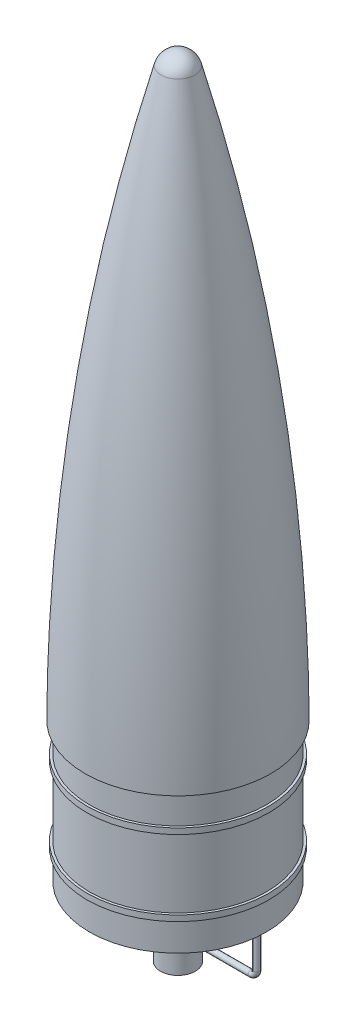
ISO-10303-21;
HEADER;
FILE_DESCRIPTION(('STEP AP214'),'2;1');
FILE_NAME('part.step','',(''),(''),'','','');
FILE_SCHEMA(('AUTOMOTIVE_DESIGN { 1 0 10303 214 1 1 1 1 }'));
ENDSEC;
DATA;
#1=APPLICATION_CONTEXT('core data for automotive mechanical design processes');
#2=APPLICATION_PROTOCOL_DEFINITION('international standard','automotive_design',2000,#1);
#3=PRODUCT_CONTEXT('',#1,'mechanical');
#4=PRODUCT('Part','Part','',(#3));
#5=PRODUCT_RELATED_PRODUCT_CATEGORY('part','',(#4));
#6=PRODUCT_DEFINITION_FORMATION('','',#4);
#7=PRODUCT_DEFINITION_CONTEXT('part definition',#1,'design');
#8=PRODUCT_DEFINITION('design','',#6,#7);
#9=PRODUCT_DEFINITION_SHAPE('','',#8);
#10=(LENGTH_UNIT() NAMED_UNIT(*) SI_UNIT(.MILLI.,.METRE.));
#11=(NAMED_UNIT(*) PLANE_ANGLE_UNIT() SI_UNIT($,.RADIAN.));
#12=(NAMED_UNIT(*) SI_UNIT($,.STERADIAN.) SOLID_ANGLE_UNIT());
#13=UNCERTAINTY_MEASURE_WITH_UNIT(LENGTH_MEASURE(1.E-05),#10,'distance_accuracy_value','');
#14=(GEOMETRIC_REPRESENTATION_CONTEXT(3) GLOBAL_UNCERTAINTY_ASSIGNED_CONTEXT((#13)) GLOBAL_UNIT_ASSIGNED_CONTEXT((#10,
#11,#12)) REPRESENTATION_CONTEXT('',''));
#15=CARTESIAN_POINT('',(0.,0.,0.));
#16=DIRECTION('',(0.,0.,1.));
#17=DIRECTION('',(1.,0.,0.));
#18=AXIS2_PLACEMENT_3D('',#15,#16,#17);
#19=CARTESIAN_POINT('',(0.,431.8,0.));
#20=DIRECTION('',(0.,1.,0.));
#21=DIRECTION('',(0.,0.,1.));
#22=AXIS2_PLACEMENT_3D('',#19,#20,#21);
#23=CYLINDRICAL_SURFACE('',#22,48.48225);
#24=CARTESIAN_POINT('',(0.,57.15,0.));
#25=DIRECTION('',(0.,-1.,0.));
#26=DIRECTION('',(1.,0.,0.));
#27=AXIS2_PLACEMENT_3D('',#24,#25,#26);
#28=CIRCLE('',#27,48.48225);
#29=CARTESIAN_POINT('',(48.48225,57.15,0.));
#30=VERTEX_POINT('',#29);
#31=EDGE_CURVE('E50',#30,#30,#28,.T.);
#32=ORIENTED_EDGE('',*,*,#31,.F.);
#33=EDGE_LOOP('',(#32));
#34=FACE_BOUND('',#33,.T.);
#35=CARTESIAN_POINT('',(0.,95.25,0.));
#36=DIRECTION('',(0.,1.,0.));
#37=DIRECTION('',(-1.,0.,0.));
#38=AXIS2_PLACEMENT_3D('',#35,#36,#37);
#39=CIRCLE('',#38,48.48225);
#40=CARTESIAN_POINT('',(-48.48225,95.25,0.));
#41=VERTEX_POINT('',#40);
#42=EDGE_CURVE('E42',#41,#41,#39,.T.);
#43=ORIENTED_EDGE('',*,*,#42,.F.);
#44=EDGE_LOOP('',(#43));
#45=FACE_BOUND('',#44,.T.);
#46=ADVANCED_FACE('F35',(#34,#45),#23,.T.);
#47=CARTESIAN_POINT('',(0.,38.1,0.));
#48=DIRECTION('',(0.,1.,0.));
#49=DIRECTION('',(0.,0.,1.));
#50=AXIS2_PLACEMENT_3D('',#47,#48,#49);
#51=CIRCLE('',#50,48.48225);
#52=CARTESIAN_POINT('',(0.,38.1,48.48225));
#53=VERTEX_POINT('',#52);
#54=EDGE_CURVE('E124',#53,#53,#51,.T.);
#55=ORIENTED_EDGE('',*,*,#54,.T.);
#56=EDGE_LOOP('',(#55));
#57=FACE_BOUND('',#56,.T.);
#58=CARTESIAN_POINT('',(0.,53.975,0.));
#59=DIRECTION('',(0.,1.,0.));
#60=DIRECTION('',(-1.,0.,0.));
#61=AXIS2_PLACEMENT_3D('',#58,#59,#60);
#62=CIRCLE('',#61,48.48225);
#63=CARTESIAN_POINT('',(-48.48225,53.975,0.));
#64=VERTEX_POINT('',#63);
#65=EDGE_CURVE('E46',#64,#64,#62,.T.);
#66=ORIENTED_EDGE('',*,*,#65,.F.);
#67=EDGE_LOOP('',(#66));
#68=FACE_BOUND('',#67,.T.);
#69=ADVANCED_FACE('F103',(#57,#68),#23,.T.);
#70=CARTESIAN_POINT('',(0.,0.,0.));
#71=DIRECTION('',(0.,1.,0.));
#72=DIRECTION('',(0.,0.,1.));
#73=AXIS2_PLACEMENT_3D('',#70,#71,#72);
#74=PLANE('',#73);
#75=CARTESIAN_POINT('',(0.,0.,0.));
#76=DIRECTION('',(0.,1.,0.));
#77=DIRECTION('',(0.,0.,1.));
#78=AXIS2_PLACEMENT_3D('',#75,#76,#77);
#79=CIRCLE('',#78,9.525);
#80=CARTESIAN_POINT('',(0.,0.,9.525));
#81=VERTEX_POINT('',#80);
#82=EDGE_CURVE('E55',#81,#81,#79,.T.);
#83=ORIENTED_EDGE('',*,*,#82,.F.);
#84=EDGE_LOOP('',(#83));
#85=FACE_BOUND('',#84,.T.);
#86=ADVANCED_FACE('F37',(#85),#74,.F.);
#87=CARTESIAN_POINT('',(0.,431.8,0.));
#88=DIRECTION('',(0.,1.,0.));
#89=DIRECTION('',(0.,0.,1.));
#90=AXIS2_PLACEMENT_3D('',#87,#88,#89);
#91=CYLINDRICAL_SURFACE('',#90,9.525);
#92=CARTESIAN_POINT('',(0.,12.7,0.));
#93=DIRECTION('',(0.,1.,0.));
#94=DIRECTION('',(0.,0.,1.));
#95=AXIS2_PLACEMENT_3D('',#92,#93,#94);
#96=CIRCLE('',#95,9.525);
#97=CARTESIAN_POINT('',(0.,12.7,9.525));
#98=VERTEX_POINT('',#97);
#99=EDGE_CURVE('E127',#98,#98,#96,.T.);
#100=ORIENTED_EDGE('',*,*,#99,.F.);
#101=EDGE_LOOP('',(#100));
#102=FACE_BOUND('',#101,.T.);
#103=ORIENTED_EDGE('',*,*,#82,.T.);
#104=EDGE_LOOP('',(#103));
#105=FACE_BOUND('',#104,.T.);
#106=ADVANCED_FACE('F110',(#102,#105),#91,.T.);
#107=CARTESIAN_POINT('',(0.,12.7,0.));
#108=DIRECTION('',(0.,1.,0.));
#109=DIRECTION('',(0.,0.,1.));
#110=AXIS2_PLACEMENT_3D('',#107,#108,#109);
#111=CONICAL_SURFACE('',#110,9.525,0.993018703001747);
#112=CARTESIAN_POINT('',(9.71792012786062,12.8294769945981,-0.331873864329069));
#113=CARTESIAN_POINT('',(9.70234682423112,12.8181502462647,-0.278876205071059));
#114=CARTESIAN_POINT('',(9.690245885196,12.8093283237202,-0.224263794411824));
#115=CARTESIAN_POINT('',(9.67397488450153,12.7974600952664,-0.113238438812971));
#116=CARTESIAN_POINT('',(9.66980490869855,12.7944138518817,-0.0568254743882384));
#117=CARTESIAN_POINT('',(9.66976603046798,12.7943854661708,0.0560656734355546));
#118=CARTESIAN_POINT('',(9.67390550344354,12.7974094422451,0.11254386523464));
#119=CARTESIAN_POINT('',(9.69013261747038,12.8092457483026,0.223709812647785));
#120=CARTESIAN_POINT('',(9.70222328557655,12.8180602827755,0.27839687804482));
#121=CARTESIAN_POINT('',(9.7328002773234,12.8402997037239,0.382569050190762));
#122=CARTESIAN_POINT('',(9.75102642970972,12.8535369015014,0.432172817017599));
#123=CARTESIAN_POINT('',(9.79288203723764,12.8838507510529,0.5277532124771));
#124=CARTESIAN_POINT('',(9.81651294528397,12.9009284352046,0.573728861322175));
#125=CARTESIAN_POINT('',(9.88453029076941,12.9499246163197,0.689714485216178));
#126=CARTESIAN_POINT('',(9.93258150228084,12.9843909325633,0.756498243839695));
#127=CARTESIAN_POINT('',(10.0367911171979,13.058686877832,0.880053044916495));
#128=CARTESIAN_POINT('',(10.0929734847468,13.0985323360795,0.936793348230162));
#129=CARTESIAN_POINT('',(10.1995530609206,13.1736583539186,1.03111905244148));
#130=CARTESIAN_POINT('',(10.2489906117193,13.2083469859976,1.0702906364624));
#131=CARTESIAN_POINT('',(10.3506276755289,13.2793187542795,1.14326788941303));
#132=CARTESIAN_POINT('',(10.4028289066843,13.3156028799481,1.17707016682207));
#133=CARTESIAN_POINT('',(10.562666367046,13.4261766250602,1.27128485521241));
#134=CARTESIAN_POINT('',(10.6734562427718,13.5021310626566,1.32443807385309));
#135=CARTESIAN_POINT('',(10.8823612009107,13.6440886657369,1.40764144318804));
#136=CARTESIAN_POINT('',(10.9797938844154,13.7098187138888,1.4399910176596));
#137=CARTESIAN_POINT('',(11.1770674531652,13.8420000020148,1.49458360945559));
#138=CARTESIAN_POINT('',(11.2769099455762,13.9084517060689,1.5168196740367));
#139=CARTESIAN_POINT('',(11.4782978012922,14.0416564874555,1.55214300396213));
#140=CARTESIAN_POINT('',(11.5798465088844,14.1084099064861,1.5652094369055));
#141=CARTESIAN_POINT('',(11.7837732229194,14.2417037507747,1.58272468726674));
#142=CARTESIAN_POINT('',(11.8861510134818,14.3082442255594,1.58717567987911));
#143=CARTESIAN_POINT('',(12.0974104864671,14.4448469821379,1.58780879162158));
#144=CARTESIAN_POINT('',(12.2063125753617,14.514880049168,1.58347683282436));
#145=CARTESIAN_POINT('',(12.4239236980526,14.6541345976742,1.56555880756651));
#146=CARTESIAN_POINT('',(12.5326326639712,14.7233558288427,1.55196995953185));
#147=CARTESIAN_POINT('',(12.7487882817751,14.8603853403101,1.51532856986863));
#148=CARTESIAN_POINT('',(12.8562380983394,14.9281978663646,1.49231086443832));
#149=CARTESIAN_POINT('',(13.069431664445,15.0622128167922,1.43617839394185));
#150=CARTESIAN_POINT('',(13.1751765132187,15.1284162937737,1.40307043278303));
#151=CARTESIAN_POINT('',(13.3755186798596,15.253400412486,1.32872041539206));
#152=CARTESIAN_POINT('',(13.4703296055769,15.3123503942751,1.28834428699253));
#153=CARTESIAN_POINT('',(13.6565308418952,15.4277862171092,1.19655322086597));
#154=CARTESIAN_POINT('',(13.7479133090516,15.4842664516535,1.14511459204941));
#155=CARTESIAN_POINT('',(13.8809795674071,15.5663007195326,1.05781014499438));
#156=CARTESIAN_POINT('',(13.9249298303673,15.5933588539728,1.02679039000075));
#157=CARTESIAN_POINT('',(14.0108271862463,15.6461780778968,0.961009353810903));
#158=CARTESIAN_POINT('',(14.0527734644505,15.6719386400835,0.926246569272269));
#159=CARTESIAN_POINT('',(14.1338179694739,15.7216560281489,0.852742181480355));
#160=CARTESIAN_POINT('',(14.1729275514963,15.745620060102,0.814018130932006));
#161=CARTESIAN_POINT('',(14.2475467978391,15.7912980272444,0.732085614867825));
#162=CARTESIAN_POINT('',(14.2830609478459,15.8130147669402,0.68888287674134));
#163=CARTESIAN_POINT('',(14.3474776058723,15.8523730138236,0.600076541764006));
#164=CARTESIAN_POINT('',(14.3766343512752,15.87017173612,0.554730535696154));
#165=CARTESIAN_POINT('',(14.4291973766746,15.9022390876583,0.459607309835219));
#166=CARTESIAN_POINT('',(14.4526055270338,15.9165088650882,0.409831538510502));
#167=CARTESIAN_POINT('',(14.4921750239619,15.9406206941399,0.305663182336561));
#168=CARTESIAN_POINT('',(14.5082466442182,15.9504079284691,0.251222629430065));
#169=CARTESIAN_POINT('',(14.5309501346764,15.9642314373078,0.139714044207685));
#170=CARTESIAN_POINT('',(14.5375977130451,15.9682772816831,0.0826505482015541));
#171=CARTESIAN_POINT('',(14.5404261793643,15.9699988448036,-0.024582962731988));
#172=CARTESIAN_POINT('',(14.5378242025952,15.9684153224022,-0.0747123091503758));
#173=CARTESIAN_POINT('',(14.5250777014681,15.960655907863,-0.17363855565078));
#174=CARTESIAN_POINT('',(14.514928507659,15.9544771726741,-0.22243461144289));
#175=CARTESIAN_POINT('',(14.4855919198532,15.9366095966932,-0.325993973809017));
#176=CARTESIAN_POINT('',(14.4651043849663,15.9241278472053,-0.380245861444786));
#177=CARTESIAN_POINT('',(14.416912672258,15.8947464973784,-0.484127362981935));
#178=CARTESIAN_POINT('',(14.3891964053464,15.8778394962258,-0.533749042913021));
#179=CARTESIAN_POINT('',(14.3129265502568,15.8312735496612,-0.652177844056969));
#180=CARTESIAN_POINT('',(14.2609421728165,15.7995009132356,-0.717917078555695));
#181=CARTESIAN_POINT('',(14.1492053742958,15.7310953512532,-0.83947151564278));
#182=CARTESIAN_POINT('',(14.0894335714944,15.6944502941424,-0.895261105831998));
#183=CARTESIAN_POINT('',(13.9720580618952,15.6223561398257,-0.992286682817142));
#184=CARTESIAN_POINT('',(13.9149998414127,15.5872568457826,-1.03445915234732));
#185=CARTESIAN_POINT('',(13.7980599986478,15.5151934974828,-1.11294299076236));
#186=CARTESIAN_POINT('',(13.7381762623675,15.4782280455077,-1.14924987832008));
#187=CARTESIAN_POINT('',(13.6163275870007,15.4028676707748,-1.21669191691211));
#188=CARTESIAN_POINT('',(13.5543601331485,15.3644710142085,-1.247820527933));
#189=CARTESIAN_POINT('',(13.4289339251507,15.2865928512073,-1.30538474879593));
#190=CARTESIAN_POINT('',(13.3654746778349,15.247110985263,-1.3318187812367));
#191=CARTESIAN_POINT('',(13.191754095846,15.1387891156322,-1.39774844292457));
#192=CARTESIAN_POINT('',(13.0804266363215,15.0691146642096,-1.43309448543396));
#193=CARTESIAN_POINT('',(12.8558843323473,14.9279847209812,-1.49258419086664));
#194=CARTESIAN_POINT('',(12.7426682241335,14.8565280193632,-1.51672001335431));
#195=CARTESIAN_POINT('',(12.5149020541328,14.7120907147656,-1.5545811151796));
#196=CARTESIAN_POINT('',(12.4003486761167,14.639105588058,-1.56826898274799));
#197=CARTESIAN_POINT('',(12.1710921245422,14.4922676540591,-1.58538197207681));
#198=CARTESIAN_POINT('',(12.0563890117198,14.4184151362804,-1.58881042562458));
#199=CARTESIAN_POINT('',(11.8226286533444,14.2670242856561,-1.58522403735191));
#200=CARTESIAN_POINT('',(11.7035928651214,14.1894623780841,-1.57776050834938));
#201=CARTESIAN_POINT('',(11.4668405095103,14.0341492827066,-1.55094887397866));
#202=CARTESIAN_POINT('',(11.3491248902171,13.956398002283,-1.53159272276651));
#203=CARTESIAN_POINT('',(11.117010224213,13.8019316516801,-1.47999426544304));
#204=CARTESIAN_POINT('',(11.0025939729551,13.7252131319097,-1.4478412113652));
#205=CARTESIAN_POINT('',(10.7779778376112,13.5733660425868,-1.36885102905248));
#206=CARTESIAN_POINT('',(10.6677709307857,13.4982349274776,-1.32203967507807));
#207=CARTESIAN_POINT('',(10.484987201952,13.372534345871,-1.22703463914319));
#208=CARTESIAN_POINT('',(10.410744899715,13.3211452234658,-1.18315565818617));
#209=CARTESIAN_POINT('',(10.267004952571,13.2210131459554,-1.08508968289926));
#210=CARTESIAN_POINT('',(10.1975174555328,13.1722758933149,-1.03088152234788));
#211=CARTESIAN_POINT('',(10.0649011770931,13.0786725886722,-0.909790526947899));
#212=CARTESIAN_POINT('',(10.0018822838863,13.0338748586243,-0.842731246432062));
#213=CARTESIAN_POINT('',(9.88772521354572,12.9522548976408,-0.695182380960154));
#214=CARTESIAN_POINT('',(9.8365145181934,12.9153840848246,-0.614780288626693));
#215=CARTESIAN_POINT('',(9.77898922796571,12.8737942292957,-0.496855559462361));
#216=CARTESIAN_POINT('',(9.76495315241051,12.8636266470958,-0.464927561201413));
#217=CARTESIAN_POINT('',(9.73943588972769,12.8451172082708,-0.39951542465359));
#218=CARTESIAN_POINT('',(9.72795686928084,12.8367769000555,-0.366029995520273));
#219=CARTESIAN_POINT('',(9.71792012786062,12.8294769945981,-0.331873864329069));
#220=B_SPLINE_CURVE_WITH_KNOTS('',3,(#112,#113,#114,#115,#116,#117,#118,#119,#120,#121,#122,
#123,#124,#125,#126,#127,#128,#129,#130,#131,#132,#133,#134,#135,#136,#137,#138,#139,#140,#141,
#142,#143,#144,#145,#146,#147,#148,#149,#150,#151,#152,#153,#154,#155,#156,#157,#158,#159,#160,
#161,#162,#163,#164,#165,#166,#167,#168,#169,#170,#171,#172,#173,#174,#175,#176,#177,#178,#179,
#180,#181,#182,#183,#184,#185,#186,#187,#188,#189,#190,#191,#192,#193,#194,#195,#196,#197,#198,
#199,#200,#201,#202,#203,#204,#205,#206,#207,#208,#209,#210,#211,#212,#213,#214,#215,#216,#217,
#218,#219),.UNSPECIFIED.,.T.,.F.,(4,2,2,2,2,2,2,2,2,2,2,2,2,2,2,2,2,2,2,2,2,2,2,2,2,2,2,2,2,2,2,
2,2,2,2,2,2,2,2,2,2,2,2,2,2,2,2,2,2,2,2,2,2,4),(0.,0.169031291006167,0.338064411844661,
0.507267993014323,0.676536028050536,0.839379343233413,1.00226648546445,1.26834697002767,
1.53522824945414,1.75088013121028,1.96666769233475,2.39859527165381,2.7638688000619,
3.12939306521566,3.49574509640138,3.86200462031128,4.25031967175685,4.63875145829183,
5.02576089200557,5.41250993864801,5.76822383055607,6.12470723139269,6.30522793843544,
6.48582142180681,6.66564675662221,6.84524490132853,7.01509488554096,7.18488953393632,
7.35670853551915,7.52824080793901,7.6780844955421,7.82802096841005,8.0050044907794,
8.18228591383001,8.44967465302028,8.71774207046241,8.95488156530503,9.1922013874927,
9.42981869882789,9.66751570030069,10.0749245367559,10.4826178877453,10.8917643355774,
11.3007778969721,11.7271232659136,12.1537573929783,12.5774666875973,13.0004351019795,
13.3010842109667,13.602356157973,13.9081069186382,14.2119267352311,14.3207727776414,
14.4297107011621),.UNSPECIFIED.);
#221=CARTESIAN_POINT('',(9.71792012786062,12.8294769945981,-0.331873864329069));
#222=VERTEX_POINT('',#221);
#223=EDGE_CURVE('E56',#222,#222,#220,.T.);
#224=ORIENTED_EDGE('',*,*,#223,.T.);
#225=EDGE_LOOP('',(#224));
#226=FACE_BOUND('',#225,.T.);
#227=CARTESIAN_POINT('',(41.9153050627506,33.8255339393897,-0.959533706239629));
#228=CARTESIAN_POINT('',(41.8692315691889,33.7945960328626,-0.898800283840115));
#229=CARTESIAN_POINT('',(41.8268771007206,33.7661017960577,-0.833873759002929));
#230=CARTESIAN_POINT('',(41.7513223542131,33.7152089595963,-0.696554529201617));
#231=CARTESIAN_POINT('',(41.7181356095259,33.6928193722219,-0.624151000882072));
#232=CARTESIAN_POINT('',(41.6624914950607,33.6552467849517,-0.473101120131703));
#233=CARTESIAN_POINT('',(41.6400856126577,33.640098369741,-0.394426861562329));
#234=CARTESIAN_POINT('',(41.6076228500856,33.6181421912568,-0.233479505524288));
#235=CARTESIAN_POINT('',(41.5975548867529,33.6113269423051,-0.151209706850272));
#236=CARTESIAN_POINT('',(41.5906800302956,33.6066735943377,0.00778514109623921));
#237=CARTESIAN_POINT('',(41.5929151666395,33.6081869903966,0.0844514430762612));
#238=CARTESIAN_POINT('',(41.6083137736467,33.6186078976796,0.236157964808962));
#239=CARTESIAN_POINT('',(41.6214771566517,33.627515349594,0.311198197599842));
#240=CARTESIAN_POINT('',(41.6575548984403,33.6519068860135,0.455785839779962));
#241=CARTESIAN_POINT('',(41.6802286280146,33.6672286592624,0.525421675267382));
#242=CARTESIAN_POINT('',(41.7342145991734,33.7036665525621,0.659618535088905));
#243=CARTESIAN_POINT('',(41.7655287334266,33.7247839421293,0.72417844356237));
#244=CARTESIAN_POINT('',(41.8385772486369,33.773974296613,0.852435049060739));
#245=CARTESIAN_POINT('',(41.8809752316405,33.8024886363411,0.915582254189327));
#246=CARTESIAN_POINT('',(41.9729386375162,33.8642238003627,1.03381696418008));
#247=CARTESIAN_POINT('',(42.0225076001372,33.8974469488596,1.08890046144779));
#248=CARTESIAN_POINT('',(42.1354350956752,33.9729812130036,1.19838914954584));
#249=CARTESIAN_POINT('',(42.1997423304363,34.0159044876428,1.25139182583883));
#250=CARTESIAN_POINT('',(42.3340696078928,34.1053354290488,1.34584943640886));
#251=CARTESIAN_POINT('',(42.4040930205714,34.1518452093392,1.38729749413932));
#252=CARTESIAN_POINT('',(42.5604122132503,34.2553952670454,1.46461454900542));
#253=CARTESIAN_POINT('',(42.647459985828,34.3128881669709,1.49836193214877));
#254=CARTESIAN_POINT('',(42.824938521502,34.4297312777485,1.55004561939068));
#255=CARTESIAN_POINT('',(42.9153711520772,34.4890825108301,1.56797305724261));
#256=CARTESIAN_POINT('',(43.1089944896357,34.6157479987403,1.58925731237115));
#257=CARTESIAN_POINT('',(43.2123733376732,34.6831347306714,1.59052511521061));
#258=CARTESIAN_POINT('',(43.4182173005834,34.8168362372206,1.5729232743034));
#259=CARTESIAN_POINT('',(43.5206817218885,34.8831502248148,1.5540394709773));
#260=CARTESIAN_POINT('',(43.7242689059059,35.0144655635605,1.49513986080889));
#261=CARTESIAN_POINT('',(43.8252908816051,35.079390359536,1.45459762915591));
#262=CARTESIAN_POINT('',(44.0193902186268,35.2037397234418,1.35188542527866));
#263=CARTESIAN_POINT('',(44.1124798719621,35.2631728138999,1.28974970245194));
#264=CARTESIAN_POINT('',(44.2637221566583,35.3594722420073,1.16308618004426));
#265=CARTESIAN_POINT('',(44.3246898418057,35.3982032885124,1.10331752612184));
#266=CARTESIAN_POINT('',(44.4375750752096,35.469792483261,0.972675798195281));
#267=CARTESIAN_POINT('',(44.4894972061784,35.5026536055753,0.901808381873515));
#268=CARTESIAN_POINT('',(44.5822104069712,35.5612523034948,0.749635584785719));
#269=CARTESIAN_POINT('',(44.6229196203042,35.5869375120073,0.66825950119109));
#270=CARTESIAN_POINT('',(44.6902429770067,35.6293773273683,0.497697493322636));
#271=CARTESIAN_POINT('',(44.716868922475,35.6461394120737,0.408518181615026));
#272=CARTESIAN_POINT('',(44.7517919628782,35.6681168141808,0.237228994130089));
#273=CARTESIAN_POINT('',(44.7619844312026,35.6745263620043,0.155655719251646));
#274=CARTESIAN_POINT('',(44.7695944037367,35.6793123287957,-0.00830340583892387));
#275=CARTESIAN_POINT('',(44.7670183689371,35.6776928105516,-0.0906888240395118));
#276=CARTESIAN_POINT('',(44.7499331320921,35.666946038386,-0.247420786426202));
#277=CARTESIAN_POINT('',(44.7363287165573,35.6583880230182,-0.321908460998084));
#278=CARTESIAN_POINT('',(44.6990341991509,35.6349091328954,-0.467248010715735));
#279=CARTESIAN_POINT('',(44.6753437067996,35.6199880117943,-0.538099744977987));
#280=CARTESIAN_POINT('',(44.6181035550231,35.5838972591317,-0.676608956137665));
#281=CARTESIAN_POINT('',(44.5842790706759,35.5625533656638,-0.744106510898043));
#282=CARTESIAN_POINT('',(44.508461737126,35.5146448137959,-0.872294640378251));
#283=CARTESIAN_POINT('',(44.4664660012062,35.4880783103324,-0.932982797511775));
#284=CARTESIAN_POINT('',(44.3707178006843,35.4274099441266,-1.05303071376925));
#285=CARTESIAN_POINT('',(44.3161793251332,35.3928000290509,-1.11150462159372));
#286=CARTESIAN_POINT('',(44.2006164736021,35.3193148375698,-1.21848612763618));
#287=CARTESIAN_POINT('',(44.1395887568328,35.2804373638049,-1.26698855427969));
#288=CARTESIAN_POINT('',(44.0029931941094,35.1932265586252,-1.36039851287312));
#289=CARTESIAN_POINT('',(43.9266262664002,35.144354770844,-1.4036343118981));
#290=CARTESIAN_POINT('',(43.7695580263272,35.0435616802178,-1.4765109181849));
#291=CARTESIAN_POINT('',(43.6888543335794,34.9916387011271,-1.50614417229048));
#292=CARTESIAN_POINT('',(43.5127129379393,34.8779888966361,-1.55531770258986));
#293=CARTESIAN_POINT('',(43.4168694065561,34.8159527236179,-1.57270063969017));
#294=CARTESIAN_POINT('',(43.2242467508944,34.6908544431942,-1.589829789591));
#295=CARTESIAN_POINT('',(43.1274670848259,34.6277917252237,-1.58956509196862));
#296=CARTESIAN_POINT('',(42.92645015896,34.496364977135,-1.57065896469337));
#297=CARTESIAN_POINT('',(42.8223385699792,34.4280425013127,-1.55034226201089));
#298=CARTESIAN_POINT('',(42.6186657249532,34.2939047656094,-1.48874837352725));
#299=CARTESIAN_POINT('',(42.5191054606344,34.2280900526812,-1.44746664298606));
#300=CARTESIAN_POINT('',(42.3439819156132,34.111937719774,-1.35256893509769));
#301=CARTESIAN_POINT('',(42.2671813469113,34.0608464123432,-1.30214582508345));
#302=CARTESIAN_POINT('',(42.1217662425425,33.9638630094192,-1.18694592318231));
#303=CARTESIAN_POINT('',(42.0531224706502,33.917952376723,-1.12222292886292));
#304=CARTESIAN_POINT('',(41.9641358872392,33.8583089211974,-1.02145136866022));
#305=CARTESIAN_POINT('',(41.9392194987753,33.8415922525148,-0.991057374888457));
#306=CARTESIAN_POINT('',(41.9153050627506,33.8255339393897,-0.959533706239629));
#307=B_SPLINE_CURVE_WITH_KNOTS('',3,(#227,#228,#229,#230,#231,#232,#233,#234,#235,#236,#237,
#238,#239,#240,#241,#242,#243,#244,#245,#246,#247,#248,#249,#250,#251,#252,#253,#254,#255,#256,
#257,#258,#259,#260,#261,#262,#263,#264,#265,#266,#267,#268,#269,#270,#271,#272,#273,#274,#275,
#276,#277,#278,#279,#280,#281,#282,#283,#284,#285,#286,#287,#288,#289,#290,#291,#292,#293,#294,
#295,#296,#297,#298,#299,#300,#301,#302,#303,#304,#305,#306),.UNSPECIFIED.,.T.,.F.,(4,2,2,2,2,2,
2,2,2,2,2,2,2,2,2,2,2,2,2,2,2,2,2,2,2,2,2,2,2,2,2,2,2,2,2,2,2,2,2,4),(0.,0.246703285081248,
0.493768829639317,0.742002881197368,0.990013780041562,1.21900065183777,1.44798568688413,
1.67149661559303,1.89505654298151,2.13780093627883,2.38066556486404,2.66081686368906,
2.94113453586844,3.26875365649382,3.59655627399025,3.96512023718746,4.33394334345364,
4.71216847493682,5.08979642173221,5.36993075279959,5.64992274519655,5.93190760065431,
6.21365577048049,6.45969351858583,6.70560678183611,6.93317020028433,7.16074242959371,
7.39515184269237,7.62964421814934,7.89001689577129,8.15052427339647,8.45069561468584,
8.75103343265749,9.09605168812502,9.44128324866266,9.81802849538583,10.1948554467714,
10.5090159699286,10.8220141279024,10.9500654101489),.UNSPECIFIED.);
#308=CARTESIAN_POINT('',(41.9153050627506,33.8255339393897,-0.959533706239629));
#309=VERTEX_POINT('',#308);
#310=EDGE_CURVE('E65',#309,#309,#307,.T.);
#311=ORIENTED_EDGE('',*,*,#310,.T.);
#312=EDGE_LOOP('',(#311));
#313=FACE_BOUND('',#312,.T.);
#314=ORIENTED_EDGE('',*,*,#54,.F.);
#315=EDGE_LOOP('',(#314));
#316=FACE_BOUND('',#315,.T.);
#317=ORIENTED_EDGE('',*,*,#99,.T.);
#318=EDGE_LOOP('',(#317));
#319=FACE_BOUND('',#318,.T.);
#320=ADVANCED_FACE('F71',(#226,#313,#316,#319),#111,.T.);
#321=CARTESIAN_POINT('',(1.905,14.3818996136601,0.));
#322=DIRECTION('',(1.,0.,0.));
#323=DIRECTION('',(0.,0.,-1.));
#324=AXIS2_PLACEMENT_3D('',#321,#322,#323);
#325=CYLINDRICAL_SURFACE('',#324,1.5875);
#326=CARTESIAN_POINT('',(40.005,14.3818996136601,0.));
#327=DIRECTION('',(1.,0.,0.));
#328=DIRECTION('',(0.,0.,-1.));
#329=AXIS2_PLACEMENT_3D('',#326,#327,#328);
#330=CIRCLE('',#329,1.5875);
#331=CARTESIAN_POINT('',(40.005,12.7943996136601,0.));
#332=VERTEX_POINT('',#331);
#333=EDGE_CURVE('E156',#332,#332,#330,.T.);
#334=ORIENTED_EDGE('',*,*,#333,.F.);
#335=EDGE_LOOP('',(#334));
#336=FACE_BOUND('',#335,.T.);
#337=ORIENTED_EDGE('',*,*,#223,.F.);
#338=EDGE_LOOP('',(#337));
#339=FACE_BOUND('',#338,.T.);
#340=ADVANCED_FACE('F74',(#336,#339),#325,.T.);
#341=CARTESIAN_POINT('',(43.18,17.5568996136601,0.));
#342=DIRECTION('',(0.,1.,0.));
#343=DIRECTION('',(0.,0.,1.));
#344=AXIS2_PLACEMENT_3D('',#341,#342,#343);
#345=CYLINDRICAL_SURFACE('',#344,1.5875);
#346=CARTESIAN_POINT('',(43.18,17.5568996136601,0.));
#347=DIRECTION('',(0.,1.,0.));
#348=DIRECTION('',(0.,0.,-1.));
#349=AXIS2_PLACEMENT_3D('',#346,#347,#348);
#350=CIRCLE('',#349,1.5875);
#351=CARTESIAN_POINT('',(44.7675,17.5568996136601,0.));
#352=VERTEX_POINT('',#351);
#353=EDGE_CURVE('E154',#352,#352,#350,.T.);
#354=ORIENTED_EDGE('',*,*,#353,.T.);
#355=EDGE_LOOP('',(#354));
#356=FACE_BOUND('',#355,.T.);
#357=ORIENTED_EDGE('',*,*,#310,.F.);
#358=EDGE_LOOP('',(#357));
#359=FACE_BOUND('',#358,.T.);
#360=ADVANCED_FACE('F79',(#356,#359),#345,.T.);
#361=CARTESIAN_POINT('',(40.005,17.5568996136601,0.));
#362=DIRECTION('',(0.,0.,1.));
#363=DIRECTION('',(1.,0.,0.));
#364=AXIS2_PLACEMENT_3D('',#361,#362,#363);
#365=TOROIDAL_SURFACE('',#364,3.175,1.5875);
#366=CARTESIAN_POINT('',(40.005,17.5568996136601,0.));
#367=DIRECTION('',(0.,0.,1.));
#368=DIRECTION('',(1.,0.,0.));
#369=AXIS2_PLACEMENT_3D('',#366,#367,#368);
#370=CIRCLE('',#369,4.76249999999999);
#371=EDGE_CURVE('',#332,#352,#370,.T.);
#372=ORIENTED_EDGE('',*,*,#333,.T.);
#373=ORIENTED_EDGE('',*,*,#353,.F.);
#374=ORIENTED_EDGE('',*,*,#371,.T.);
#375=ORIENTED_EDGE('',*,*,#371,.F.);
#376=EDGE_LOOP('',(#372,#374,#373,#375));
#377=FACE_BOUND('',#376,.T.);
#378=ADVANCED_FACE('F83',(#377),#365,.T.);
#379=CARTESIAN_POINT('',(0.,53.975,0.));
#380=DIRECTION('',(0.,1.,0.));
#381=DIRECTION('',(-1.,0.,0.));
#382=AXIS2_PLACEMENT_3D('',#379,#380,#381);
#383=PLANE('',#382);
#384=ORIENTED_EDGE('',*,*,#65,.T.);
#385=EDGE_LOOP('',(#384));
#386=FACE_BOUND('',#385,.T.);
#387=CARTESIAN_POINT('',(0.,53.975,0.));
#388=DIRECTION('',(0.,1.,0.));
#389=DIRECTION('',(-1.,0.,0.));
#390=AXIS2_PLACEMENT_3D('',#387,#388,#389);
#391=CIRCLE('',#390,49.784);
#392=CARTESIAN_POINT('',(-49.784,53.975,0.));
#393=VERTEX_POINT('',#392);
#394=EDGE_CURVE('E160',#393,#393,#391,.T.);
#395=ORIENTED_EDGE('',*,*,#394,.F.);
#396=EDGE_LOOP('',(#395));
#397=FACE_BOUND('',#396,.T.);
#398=ADVANCED_FACE('F81',(#386,#397),#383,.F.);
#399=CARTESIAN_POINT('',(0.,57.15,0.));
#400=DIRECTION('',(0.,1.,0.));
#401=DIRECTION('',(-1.,0.,0.));
#402=AXIS2_PLACEMENT_3D('',#399,#400,#401);
#403=CYLINDRICAL_SURFACE('',#402,49.784);
#404=CARTESIAN_POINT('',(0.,57.15,0.));
#405=DIRECTION('',(0.,1.,0.));
#406=DIRECTION('',(-1.,0.,0.));
#407=AXIS2_PLACEMENT_3D('',#404,#405,#406);
#408=CIRCLE('',#407,49.784);
#409=CARTESIAN_POINT('',(-49.784,57.15,0.));
#410=VERTEX_POINT('',#409);
#411=EDGE_CURVE('E169',#410,#410,#408,.T.);
#412=ORIENTED_EDGE('',*,*,#411,.F.);
#413=EDGE_LOOP('',(#412));
#414=FACE_BOUND('',#413,.T.);
#415=ORIENTED_EDGE('',*,*,#394,.T.);
#416=EDGE_LOOP('',(#415));
#417=FACE_BOUND('',#416,.T.);
#418=ADVANCED_FACE('F194',(#414,#417),#403,.T.);
#419=CARTESIAN_POINT('',(49.784,57.15,0.));
#420=DIRECTION('',(0.,-1.,0.));
#421=DIRECTION('',(1.,0.,0.));
#422=AXIS2_PLACEMENT_3D('',#419,#420,#421);
#423=PLANE('',#422);
#424=ORIENTED_EDGE('',*,*,#31,.T.);
#425=EDGE_LOOP('',(#424));
#426=FACE_BOUND('',#425,.T.);
#427=ORIENTED_EDGE('',*,*,#411,.T.);
#428=EDGE_LOOP('',(#427));
#429=FACE_BOUND('',#428,.T.);
#430=ADVANCED_FACE('F192',(#426,#429),#423,.F.);
#431=CARTESIAN_POINT('',(0.,98.425,0.));
#432=DIRECTION('',(0.,-1.,0.));
#433=DIRECTION('',(1.,0.,0.));
#434=AXIS2_PLACEMENT_3D('',#431,#432,#433);
#435=PLANE('',#434);
#436=CARTESIAN_POINT('',(0.,98.425,0.));
#437=DIRECTION('',(0.,-1.,0.));
#438=DIRECTION('',(1.,0.,0.));
#439=AXIS2_PLACEMENT_3D('',#436,#437,#438);
#440=CIRCLE('',#439,48.48225);
#441=CARTESIAN_POINT('',(48.48225,98.425,0.));
#442=VERTEX_POINT('',#441);
#443=EDGE_CURVE('E10',#442,#442,#440,.T.);
#444=ORIENTED_EDGE('',*,*,#443,.T.);
#445=EDGE_LOOP('',(#444));
#446=FACE_BOUND('',#445,.T.);
#447=CARTESIAN_POINT('',(0.,98.425,0.));
#448=DIRECTION('',(0.,1.,0.));
#449=DIRECTION('',(-1.,0.,0.));
#450=AXIS2_PLACEMENT_3D('',#447,#448,#449);
#451=CIRCLE('',#450,49.784);
#452=CARTESIAN_POINT('',(-49.7839999999999,98.4250000000001,0.));
#453=VERTEX_POINT('',#452);
#454=EDGE_CURVE('E172',#453,#453,#451,.T.);
#455=ORIENTED_EDGE('',*,*,#454,.T.);
#456=EDGE_LOOP('',(#455));
#457=FACE_BOUND('',#456,.T.);
#458=ADVANCED_FACE('F186',(#446,#457),#435,.F.);
#459=CARTESIAN_POINT('',(0.,57.15,0.));
#460=DIRECTION('',(0.,1.,0.));
#461=DIRECTION('',(-1.,0.,0.));
#462=AXIS2_PLACEMENT_3D('',#459,#460,#461);
#463=CYLINDRICAL_SURFACE('',#462,49.784);
#464=ORIENTED_EDGE('',*,*,#454,.F.);
#465=EDGE_LOOP('',(#464));
#466=FACE_BOUND('',#465,.T.);
#467=CARTESIAN_POINT('',(0.,95.25,0.));
#468=DIRECTION('',(0.,1.,0.));
#469=DIRECTION('',(-1.,0.,0.));
#470=AXIS2_PLACEMENT_3D('',#467,#468,#469);
#471=CIRCLE('',#470,49.784);
#472=CARTESIAN_POINT('',(-49.784,95.2500000000001,0.));
#473=VERTEX_POINT('',#472);
#474=EDGE_CURVE('E175',#473,#473,#471,.T.);
#475=ORIENTED_EDGE('',*,*,#474,.T.);
#476=EDGE_LOOP('',(#475));
#477=FACE_BOUND('',#476,.T.);
#478=ADVANCED_FACE('F179',(#466,#477),#463,.T.);
#479=CARTESIAN_POINT('',(0.,95.25,0.));
#480=DIRECTION('',(0.,1.,0.));
#481=DIRECTION('',(-1.,0.,0.));
#482=AXIS2_PLACEMENT_3D('',#479,#480,#481);
#483=PLANE('',#482);
#484=ORIENTED_EDGE('',*,*,#42,.T.);
#485=EDGE_LOOP('',(#484));
#486=FACE_BOUND('',#485,.T.);
#487=ORIENTED_EDGE('',*,*,#474,.F.);
#488=EDGE_LOOP('',(#487));
#489=FACE_BOUND('',#488,.T.);
#490=ADVANCED_FACE('F94',(#486,#489),#483,.F.);
#491=CARTESIAN_POINT('',(0.,422.275,0.));
#492=DIRECTION('',(0.,1.,0.));
#493=DIRECTION('',(1.,0.,0.));
#494=AXIS2_PLACEMENT_3D('',#491,#492,#493);
#495=SPHERICAL_SURFACE('',#494,9.52500000000002);
#496=CARTESIAN_POINT('',(0.,424.730822512023,0.));
#497=DIRECTION('',(0.,1.,0.));
#498=DIRECTION('',(0.,0.,1.));
#499=AXIS2_PLACEMENT_3D('',#496,#497,#498);
#500=CIRCLE('',#499,9.20296478258176);
#501=CARTESIAN_POINT('',(0.,424.730822512023,9.20296478258176));
#502=VERTEX_POINT('',#501);
#503=EDGE_CURVE('E64',#502,#502,#500,.T.);
#504=ORIENTED_EDGE('',*,*,#503,.T.);
#505=EDGE_LOOP('',(#504));
#506=FACE_BOUND('',#505,.T.);
#507=ADVANCED_FACE('F90',(#506),#495,.T.);
#508=CARTESIAN_POINT('',(0.,107.365191018964,0.));
#509=DIRECTION('',(0.,1.,0.));
#510=DIRECTION('',(0.,0.,1.));
#511=AXIS2_PLACEMENT_3D('',#508,#509,#510);
#512=DEGENERATE_TOROIDAL_SURFACE('',#511,1180.09500587032,1230.91454092154,.F.);
#513=ORIENTED_EDGE('',*,*,#503,.F.);
#514=EDGE_LOOP('',(#513));
#515=FACE_BOUND('',#514,.T.);
#516=CARTESIAN_POINT('',(0.,114.3,0.));
#517=DIRECTION('',(0.,1.,0.));
#518=DIRECTION('',(0.,0.,1.));
#519=AXIS2_PLACEMENT_3D('',#516,#517,#518);
#520=CIRCLE('',#519,50.8);
#521=CARTESIAN_POINT('',(0.,114.3,50.8));
#522=VERTEX_POINT('',#521);
#523=EDGE_CURVE('E125',#522,#522,#520,.T.);
#524=ORIENTED_EDGE('',*,*,#523,.T.);
#525=EDGE_LOOP('',(#524));
#526=FACE_BOUND('',#525,.T.);
#527=ADVANCED_FACE('F93',(#515,#526),#512,.F.);
#528=CARTESIAN_POINT('',(48.48225,114.3,0.));
#529=DIRECTION('',(0.,1.,0.));
#530=DIRECTION('',(0.,0.,1.));
#531=AXIS2_PLACEMENT_3D('',#528,#529,#530);
#532=PLANE('',#531);
#533=ORIENTED_EDGE('',*,*,#523,.F.);
#534=EDGE_LOOP('',(#533));
#535=FACE_BOUND('',#534,.T.);
#536=CARTESIAN_POINT('',(0.,114.3,0.));
#537=DIRECTION('',(0.,1.,0.));
#538=DIRECTION('',(0.,0.,1.));
#539=AXIS2_PLACEMENT_3D('',#536,#537,#538);
#540=CIRCLE('',#539,48.48225);
#541=CARTESIAN_POINT('',(0.,114.3,48.48225));
#542=VERTEX_POINT('',#541);
#543=EDGE_CURVE('E122',#542,#542,#540,.T.);
#544=ORIENTED_EDGE('',*,*,#543,.T.);
#545=EDGE_LOOP('',(#544));
#546=FACE_BOUND('',#545,.T.);
#547=ADVANCED_FACE('F98',(#535,#546),#532,.F.);
#548=ORIENTED_EDGE('',*,*,#543,.F.);
#549=EDGE_LOOP('',(#548));
#550=FACE_BOUND('',#549,.T.);
#551=ORIENTED_EDGE('',*,*,#443,.F.);
#552=EDGE_LOOP('',(#551));
#553=FACE_BOUND('',#552,.T.);
#554=ADVANCED_FACE('F101',(#550,#553),#23,.T.);
#555=CLOSED_SHELL('',(#46,#69,#86,#106,#320,#340,#360,#378,#398,#418,#430,#458,#478,#490,#507,
#527,#547,#554));
#556=MANIFOLD_SOLID_BREP('B2',#555);
#557=ADVANCED_BREP_SHAPE_REPRESENTATION('',(#18,#556),#14);
#558=SHAPE_DEFINITION_REPRESENTATION(#9,#557);
ENDSEC;
END-ISO-10303-21;
